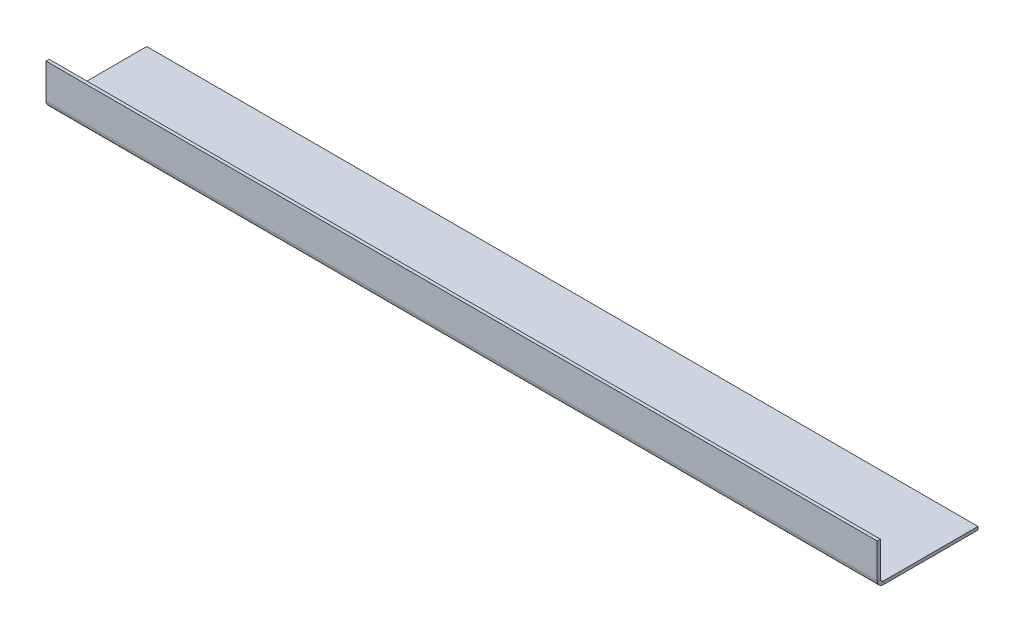
ISO-10303-21;
HEADER;
FILE_DESCRIPTION(('STEP AP214'),'2;1');
FILE_NAME('part.step','',(''),(''),'','','');
FILE_SCHEMA(('AUTOMOTIVE_DESIGN { 1 0 10303 214 1 1 1 1 }'));
ENDSEC;
DATA;
#1=APPLICATION_CONTEXT('core data for automotive mechanical design processes');
#2=APPLICATION_PROTOCOL_DEFINITION('international standard','automotive_design',2000,#1);
#3=PRODUCT_CONTEXT('',#1,'mechanical');
#4=PRODUCT('Part','Part','',(#3));
#5=PRODUCT_RELATED_PRODUCT_CATEGORY('part','',(#4));
#6=PRODUCT_DEFINITION_FORMATION('','',#4);
#7=PRODUCT_DEFINITION_CONTEXT('part definition',#1,'design');
#8=PRODUCT_DEFINITION('design','',#6,#7);
#9=PRODUCT_DEFINITION_SHAPE('','',#8);
#10=(LENGTH_UNIT() NAMED_UNIT(*) SI_UNIT(.MILLI.,.METRE.));
#11=(NAMED_UNIT(*) PLANE_ANGLE_UNIT() SI_UNIT($,.RADIAN.));
#12=(NAMED_UNIT(*) SI_UNIT($,.STERADIAN.) SOLID_ANGLE_UNIT());
#13=UNCERTAINTY_MEASURE_WITH_UNIT(LENGTH_MEASURE(1.E-05),#10,'distance_accuracy_value','');
#14=(GEOMETRIC_REPRESENTATION_CONTEXT(3) GLOBAL_UNCERTAINTY_ASSIGNED_CONTEXT((#13)) GLOBAL_UNIT_ASSIGNED_CONTEXT((#10,
#11,#12)) REPRESENTATION_CONTEXT('',''));
#15=CARTESIAN_POINT('',(0.,0.,0.));
#16=DIRECTION('',(0.,0.,1.));
#17=DIRECTION('',(1.,0.,0.));
#18=AXIS2_PLACEMENT_3D('',#15,#16,#17);
#19=CARTESIAN_POINT('',(838.2,-3.175,0.));
#20=DIRECTION('',(1.,0.,0.));
#21=DIRECTION('',(0.,0.,-1.));
#22=AXIS2_PLACEMENT_3D('',#19,#20,#21);
#23=PLANE('',#22);
#24=DIRECTION('',(0.,0.,-1.));
#25=VECTOR('',#24,1.);
#26=CARTESIAN_POINT('',(838.2,0.,0.));
#27=LINE('',#26,#25);
#28=CARTESIAN_POINT('',(838.2,0.,-6.35000000000002));
#29=VERTEX_POINT('',#28);
#30=CARTESIAN_POINT('',(838.2,0.,-101.6));
#31=VERTEX_POINT('',#30);
#32=EDGE_CURVE('E104',#29,#31,#27,.T.);
#33=ORIENTED_EDGE('',*,*,#32,.F.);
#34=DIRECTION('',(0.,-1.,0.));
#35=VECTOR('',#34,1.);
#36=CARTESIAN_POINT('',(838.2,0.,-6.35000000000002));
#37=LINE('',#36,#35);
#38=CARTESIAN_POINT('',(838.2,-3.17500000000001,-6.35000000000002));
#39=VERTEX_POINT('',#38);
#40=EDGE_CURVE('E117',#29,#39,#37,.T.);
#41=ORIENTED_EDGE('',*,*,#40,.T.);
#42=DIRECTION('',(0.,0.,-1.));
#43=VECTOR('',#42,1.);
#44=CARTESIAN_POINT('',(838.2,-3.175,0.));
#45=LINE('',#44,#43);
#46=CARTESIAN_POINT('',(838.2,-3.175,-101.6));
#47=VERTEX_POINT('',#46);
#48=EDGE_CURVE('E111',#39,#47,#45,.T.);
#49=ORIENTED_EDGE('',*,*,#48,.T.);
#50=DIRECTION('',(0.,1.,0.));
#51=VECTOR('',#50,1.);
#52=CARTESIAN_POINT('',(838.2,-3.175,-101.6));
#53=LINE('',#52,#51);
#54=EDGE_CURVE('E60',#47,#31,#53,.T.);
#55=ORIENTED_EDGE('',*,*,#54,.T.);
#56=EDGE_LOOP('',(#33,#41,#49,#55));
#57=FACE_BOUND('',#56,.T.);
#58=ADVANCED_FACE('F56',(#57),#23,.T.);
#59=CARTESIAN_POINT('',(0.,-3.175,0.));
#60=DIRECTION('',(0.,-1.,0.));
#61=DIRECTION('',(0.,0.,-1.));
#62=AXIS2_PLACEMENT_3D('',#59,#60,#61);
#63=PLANE('',#62);
#64=ORIENTED_EDGE('',*,*,#48,.F.);
#65=DIRECTION('',(1.,0.,0.));
#66=VECTOR('',#65,1.);
#67=CARTESIAN_POINT('',(838.2,-3.17500000000001,-6.35000000000002));
#68=LINE('',#67,#66);
#69=CARTESIAN_POINT('',(0.,-3.175,-6.35000000000002));
#70=VERTEX_POINT('',#69);
#71=EDGE_CURVE('E134',#39,#70,#68,.F.);
#72=ORIENTED_EDGE('',*,*,#71,.T.);
#73=DIRECTION('',(0.,0.,1.));
#74=VECTOR('',#73,1.);
#75=CARTESIAN_POINT('',(0.,-3.175,0.));
#76=LINE('',#75,#74);
#77=CARTESIAN_POINT('',(0.,-3.175,-101.6));
#78=VERTEX_POINT('',#77);
#79=EDGE_CURVE('E109',#78,#70,#76,.T.);
#80=ORIENTED_EDGE('',*,*,#79,.F.);
#81=DIRECTION('',(-1.,0.,0.));
#82=VECTOR('',#81,1.);
#83=CARTESIAN_POINT('',(0.,-3.175,-101.6));
#84=LINE('',#83,#82);
#85=EDGE_CURVE('E96',#47,#78,#84,.T.);
#86=ORIENTED_EDGE('',*,*,#85,.F.);
#87=EDGE_LOOP('',(#64,#72,#80,#86));
#88=FACE_BOUND('',#87,.T.);
#89=ADVANCED_FACE('F224',(#88),#63,.T.);
#90=CARTESIAN_POINT('',(0.,0.,0.));
#91=DIRECTION('',(0.,-1.,0.));
#92=DIRECTION('',(0.,0.,-1.));
#93=AXIS2_PLACEMENT_3D('',#90,#91,#92);
#94=PLANE('',#93);
#95=DIRECTION('',(1.,0.,0.));
#96=VECTOR('',#95,1.);
#97=CARTESIAN_POINT('',(838.2,0.,-6.35000000000002));
#98=LINE('',#97,#96);
#99=CARTESIAN_POINT('',(0.,0.,-6.35000000000002));
#100=VERTEX_POINT('',#99);
#101=EDGE_CURVE('E124',#29,#100,#98,.F.);
#102=ORIENTED_EDGE('',*,*,#101,.F.);
#103=ORIENTED_EDGE('',*,*,#32,.T.);
#104=DIRECTION('',(-1.,0.,0.));
#105=VECTOR('',#104,1.);
#106=CARTESIAN_POINT('',(0.,0.,-101.6));
#107=LINE('',#106,#105);
#108=CARTESIAN_POINT('',(0.,0.,-101.6));
#109=VERTEX_POINT('',#108);
#110=EDGE_CURVE('E94',#31,#109,#107,.T.);
#111=ORIENTED_EDGE('',*,*,#110,.T.);
#112=DIRECTION('',(0.,0.,1.));
#113=VECTOR('',#112,1.);
#114=CARTESIAN_POINT('',(0.,0.,0.));
#115=LINE('',#114,#113);
#116=EDGE_CURVE('E99',#109,#100,#115,.T.);
#117=ORIENTED_EDGE('',*,*,#116,.T.);
#118=EDGE_LOOP('',(#102,#103,#111,#117));
#119=FACE_BOUND('',#118,.T.);
#120=ADVANCED_FACE('F106',(#119),#94,.F.);
#121=CARTESIAN_POINT('',(0.,-3.175,0.));
#122=DIRECTION('',(-1.,0.,0.));
#123=DIRECTION('',(0.,0.,1.));
#124=AXIS2_PLACEMENT_3D('',#121,#122,#123);
#125=PLANE('',#124);
#126=DIRECTION('',(0.,-1.,0.));
#127=VECTOR('',#126,1.);
#128=CARTESIAN_POINT('',(0.,0.,-6.35000000000002));
#129=LINE('',#128,#127);
#130=EDGE_CURVE('E101',#100,#70,#129,.T.);
#131=ORIENTED_EDGE('',*,*,#130,.F.);
#132=ORIENTED_EDGE('',*,*,#116,.F.);
#133=DIRECTION('',(0.,1.,0.));
#134=VECTOR('',#133,1.);
#135=CARTESIAN_POINT('',(0.,-3.175,-101.6));
#136=LINE('',#135,#134);
#137=EDGE_CURVE('E13',#78,#109,#136,.T.);
#138=ORIENTED_EDGE('',*,*,#137,.F.);
#139=ORIENTED_EDGE('',*,*,#79,.T.);
#140=EDGE_LOOP('',(#131,#132,#138,#139));
#141=FACE_BOUND('',#140,.T.);
#142=ADVANCED_FACE('F58',(#141),#125,.T.);
#143=CARTESIAN_POINT('',(0.,-3.175,-101.6));
#144=DIRECTION('',(0.,0.,-1.));
#145=DIRECTION('',(-1.,0.,0.));
#146=AXIS2_PLACEMENT_3D('',#143,#144,#145);
#147=PLANE('',#146);
#148=ORIENTED_EDGE('',*,*,#110,.F.);
#149=ORIENTED_EDGE('',*,*,#54,.F.);
#150=ORIENTED_EDGE('',*,*,#85,.T.);
#151=ORIENTED_EDGE('',*,*,#137,.T.);
#152=EDGE_LOOP('',(#148,#149,#150,#151));
#153=FACE_BOUND('',#152,.T.);
#154=ADVANCED_FACE('F91',(#153),#147,.T.);
#155=CARTESIAN_POINT('',(0.,3.17499999999996,-6.35000000000002));
#156=DIRECTION('',(-1.,0.,0.));
#157=DIRECTION('',(0.,0.,1.));
#158=AXIS2_PLACEMENT_3D('',#155,#156,#157);
#159=PLANE('',#158);
#160=DIRECTION('',(0.,0.,-1.));
#161=VECTOR('',#160,1.);
#162=CARTESIAN_POINT('',(0.,3.17499999999996,0.));
#163=LINE('',#162,#161);
#164=CARTESIAN_POINT('',(0.,3.17499999999996,-3.17499999999998));
#165=VERTEX_POINT('',#164);
#166=CARTESIAN_POINT('',(0.,3.17499999999996,0.));
#167=VERTEX_POINT('',#166);
#168=EDGE_CURVE('E138',#165,#167,#163,.F.);
#169=ORIENTED_EDGE('',*,*,#168,.F.);
#170=CARTESIAN_POINT('',(0.,3.17499999999996,-6.35000000000002));
#171=DIRECTION('',(1.,0.,0.));
#172=DIRECTION('',(0.,0.,-1.));
#173=AXIS2_PLACEMENT_3D('',#170,#171,#172);
#174=CIRCLE('',#173,3.175);
#175=EDGE_CURVE('E128',#100,#165,#174,.F.);
#176=ORIENTED_EDGE('',*,*,#175,.F.);
#177=ORIENTED_EDGE('',*,*,#130,.T.);
#178=CARTESIAN_POINT('',(0.,3.17499999999996,-6.35000000000002));
#179=DIRECTION('',(1.,0.,0.));
#180=DIRECTION('',(0.,0.,-1.));
#181=AXIS2_PLACEMENT_3D('',#178,#179,#180);
#182=CIRCLE('',#181,6.35);
#183=EDGE_CURVE('E71',#70,#167,#182,.F.);
#184=ORIENTED_EDGE('',*,*,#183,.T.);
#185=EDGE_LOOP('',(#169,#176,#177,#184));
#186=FACE_BOUND('',#185,.T.);
#187=ADVANCED_FACE('F226',(#186),#159,.T.);
#188=CARTESIAN_POINT('',(838.2,3.17499999999996,-6.35000000000002));
#189=DIRECTION('',(-1.,0.,0.));
#190=DIRECTION('',(0.,0.,1.));
#191=AXIS2_PLACEMENT_3D('',#188,#189,#190);
#192=PLANE('',#191);
#193=CARTESIAN_POINT('',(838.2,3.17499999999996,-6.35000000000002));
#194=DIRECTION('',(1.,0.,0.));
#195=DIRECTION('',(0.,0.,-1.));
#196=AXIS2_PLACEMENT_3D('',#193,#194,#195);
#197=CIRCLE('',#196,3.175);
#198=CARTESIAN_POINT('',(838.2,3.17499999999996,-3.17499999999998));
#199=VERTEX_POINT('',#198);
#200=EDGE_CURVE('E121',#199,#29,#197,.T.);
#201=ORIENTED_EDGE('',*,*,#200,.F.);
#202=DIRECTION('',(0.,0.,-1.));
#203=VECTOR('',#202,1.);
#204=CARTESIAN_POINT('',(838.2,3.17499999999996,-3.17499999999998));
#205=LINE('',#204,#203);
#206=CARTESIAN_POINT('',(838.2,3.17499999999996,0.));
#207=VERTEX_POINT('',#206);
#208=EDGE_CURVE('E144',#199,#207,#205,.F.);
#209=ORIENTED_EDGE('',*,*,#208,.T.);
#210=CARTESIAN_POINT('',(838.2,3.17499999999996,-6.35000000000002));
#211=DIRECTION('',(1.,0.,0.));
#212=DIRECTION('',(0.,0.,-1.));
#213=AXIS2_PLACEMENT_3D('',#210,#211,#212);
#214=CIRCLE('',#213,6.35);
#215=EDGE_CURVE('E131',#207,#39,#214,.T.);
#216=ORIENTED_EDGE('',*,*,#215,.T.);
#217=ORIENTED_EDGE('',*,*,#40,.F.);
#218=EDGE_LOOP('',(#201,#209,#216,#217));
#219=FACE_BOUND('',#218,.T.);
#220=ADVANCED_FACE('F218',(#219),#192,.F.);
#221=CARTESIAN_POINT('',(838.2,3.17499999999996,-6.35000000000002));
#222=DIRECTION('',(1.,0.,0.));
#223=DIRECTION('',(0.,0.,1.));
#224=AXIS2_PLACEMENT_3D('',#221,#222,#223);
#225=CYLINDRICAL_SURFACE('',#224,6.35);
#226=ORIENTED_EDGE('',*,*,#71,.F.);
#227=ORIENTED_EDGE('',*,*,#215,.F.);
#228=DIRECTION('',(1.,0.,0.));
#229=VECTOR('',#228,1.);
#230=CARTESIAN_POINT('',(0.,3.17499999999996,0.));
#231=LINE('',#230,#229);
#232=EDGE_CURVE('E147',#207,#167,#231,.F.);
#233=ORIENTED_EDGE('',*,*,#232,.T.);
#234=ORIENTED_EDGE('',*,*,#183,.F.);
#235=EDGE_LOOP('',(#226,#227,#233,#234));
#236=FACE_BOUND('',#235,.T.);
#237=ADVANCED_FACE('F225',(#236),#225,.T.);
#238=CARTESIAN_POINT('',(838.2,3.17499999999996,-6.35000000000002));
#239=DIRECTION('',(1.,0.,0.));
#240=DIRECTION('',(0.,0.,1.));
#241=AXIS2_PLACEMENT_3D('',#238,#239,#240);
#242=CYLINDRICAL_SURFACE('',#241,3.175);
#243=ORIENTED_EDGE('',*,*,#101,.T.);
#244=ORIENTED_EDGE('',*,*,#175,.T.);
#245=DIRECTION('',(1.,0.,0.));
#246=VECTOR('',#245,1.);
#247=CARTESIAN_POINT('',(0.,3.17499999999996,-3.17499999999998));
#248=LINE('',#247,#246);
#249=EDGE_CURVE('E141',#165,#199,#248,.T.);
#250=ORIENTED_EDGE('',*,*,#249,.T.);
#251=ORIENTED_EDGE('',*,*,#200,.T.);
#252=EDGE_LOOP('',(#243,#244,#250,#251));
#253=FACE_BOUND('',#252,.T.);
#254=ADVANCED_FACE('F220',(#253),#242,.F.);
#255=CARTESIAN_POINT('',(0.,0.,0.));
#256=DIRECTION('',(1.,0.,0.));
#257=DIRECTION('',(0.,0.,-1.));
#258=AXIS2_PLACEMENT_3D('',#255,#256,#257);
#259=PLANE('',#258);
#260=ORIENTED_EDGE('',*,*,#168,.T.);
#261=DIRECTION('',(0.,-1.,0.));
#262=VECTOR('',#261,1.);
#263=CARTESIAN_POINT('',(0.,0.,0.));
#264=LINE('',#263,#262);
#265=CARTESIAN_POINT('',(0.,38.1,0.));
#266=VERTEX_POINT('',#265);
#267=EDGE_CURVE('E158',#266,#167,#264,.T.);
#268=ORIENTED_EDGE('',*,*,#267,.F.);
#269=DIRECTION('',(0.,0.,-1.));
#270=VECTOR('',#269,1.);
#271=CARTESIAN_POINT('',(0.,38.1,0.));
#272=LINE('',#271,#270);
#273=CARTESIAN_POINT('',(0.,38.1,-3.17499999999998));
#274=VERTEX_POINT('',#273);
#275=EDGE_CURVE('E167',#266,#274,#272,.T.);
#276=ORIENTED_EDGE('',*,*,#275,.T.);
#277=DIRECTION('',(0.,1.,0.));
#278=VECTOR('',#277,1.);
#279=CARTESIAN_POINT('',(0.,0.,-3.17499999999998));
#280=LINE('',#279,#278);
#281=EDGE_CURVE('E149',#274,#165,#280,.F.);
#282=ORIENTED_EDGE('',*,*,#281,.T.);
#283=EDGE_LOOP('',(#260,#268,#276,#282));
#284=FACE_BOUND('',#283,.T.);
#285=ADVANCED_FACE('F193',(#284),#259,.F.);
#286=CARTESIAN_POINT('',(838.200000000001,38.1,0.));
#287=DIRECTION('',(-1.,0.,0.));
#288=DIRECTION('',(0.,0.,1.));
#289=AXIS2_PLACEMENT_3D('',#286,#287,#288);
#290=PLANE('',#289);
#291=ORIENTED_EDGE('',*,*,#208,.F.);
#292=DIRECTION('',(0.,-1.,0.));
#293=VECTOR('',#292,1.);
#294=CARTESIAN_POINT('',(838.200000000001,38.1,-3.17499999999998));
#295=LINE('',#294,#293);
#296=CARTESIAN_POINT('',(838.200000000001,38.1,-3.17499999999998));
#297=VERTEX_POINT('',#296);
#298=EDGE_CURVE('E152',#199,#297,#295,.F.);
#299=ORIENTED_EDGE('',*,*,#298,.T.);
#300=DIRECTION('',(0.,0.,-1.));
#301=VECTOR('',#300,1.);
#302=CARTESIAN_POINT('',(838.200000000001,38.1,0.));
#303=LINE('',#302,#301);
#304=CARTESIAN_POINT('',(838.200000000001,38.1,0.));
#305=VERTEX_POINT('',#304);
#306=EDGE_CURVE('E125',#305,#297,#303,.T.);
#307=ORIENTED_EDGE('',*,*,#306,.F.);
#308=DIRECTION('',(0.,1.,0.));
#309=VECTOR('',#308,1.);
#310=CARTESIAN_POINT('',(838.2,0.,0.));
#311=LINE('',#310,#309);
#312=EDGE_CURVE('E161',#207,#305,#311,.T.);
#313=ORIENTED_EDGE('',*,*,#312,.F.);
#314=EDGE_LOOP('',(#291,#299,#307,#313));
#315=FACE_BOUND('',#314,.T.);
#316=ADVANCED_FACE('F215',(#315),#290,.F.);
#317=CARTESIAN_POINT('',(0.,0.,0.));
#318=DIRECTION('',(0.,0.,-1.));
#319=DIRECTION('',(-1.,0.,0.));
#320=AXIS2_PLACEMENT_3D('',#317,#318,#319);
#321=PLANE('',#320);
#322=ORIENTED_EDGE('',*,*,#232,.F.);
#323=ORIENTED_EDGE('',*,*,#312,.T.);
#324=DIRECTION('',(-1.,0.,0.));
#325=VECTOR('',#324,1.);
#326=CARTESIAN_POINT('',(0.,38.1,0.));
#327=LINE('',#326,#325);
#328=EDGE_CURVE('E164',#305,#266,#327,.T.);
#329=ORIENTED_EDGE('',*,*,#328,.T.);
#330=ORIENTED_EDGE('',*,*,#267,.T.);
#331=EDGE_LOOP('',(#322,#323,#329,#330));
#332=FACE_BOUND('',#331,.T.);
#333=ADVANCED_FACE('F213',(#332),#321,.F.);
#334=CARTESIAN_POINT('',(0.,0.,-3.17499999999998));
#335=DIRECTION('',(0.,0.,-1.));
#336=DIRECTION('',(-1.,0.,0.));
#337=AXIS2_PLACEMENT_3D('',#334,#335,#336);
#338=PLANE('',#337);
#339=ORIENTED_EDGE('',*,*,#298,.F.);
#340=ORIENTED_EDGE('',*,*,#249,.F.);
#341=ORIENTED_EDGE('',*,*,#281,.F.);
#342=DIRECTION('',(1.,0.,0.));
#343=VECTOR('',#342,1.);
#344=CARTESIAN_POINT('',(0.,38.1,-3.17499999999998));
#345=LINE('',#344,#343);
#346=EDGE_CURVE('E155',#297,#274,#345,.F.);
#347=ORIENTED_EDGE('',*,*,#346,.F.);
#348=EDGE_LOOP('',(#339,#340,#341,#347));
#349=FACE_BOUND('',#348,.T.);
#350=ADVANCED_FACE('F187',(#349),#338,.T.);
#351=CARTESIAN_POINT('',(0.,38.1,0.));
#352=DIRECTION('',(0.,-1.,0.));
#353=DIRECTION('',(0.,0.,-1.));
#354=AXIS2_PLACEMENT_3D('',#351,#352,#353);
#355=PLANE('',#354);
#356=ORIENTED_EDGE('',*,*,#346,.T.);
#357=ORIENTED_EDGE('',*,*,#275,.F.);
#358=ORIENTED_EDGE('',*,*,#328,.F.);
#359=ORIENTED_EDGE('',*,*,#306,.T.);
#360=EDGE_LOOP('',(#356,#357,#358,#359));
#361=FACE_BOUND('',#360,.T.);
#362=ADVANCED_FACE('F176',(#361),#355,.F.);
#363=CLOSED_SHELL('',(#58,#89,#120,#142,#154,#187,#220,#237,#254,#285,#316,#333,#350,#362));
#364=MANIFOLD_SOLID_BREP('B2',#363);
#365=ADVANCED_BREP_SHAPE_REPRESENTATION('',(#18,#364),#14);
#366=SHAPE_DEFINITION_REPRESENTATION(#9,#365);
ENDSEC;
END-ISO-10303-21;
